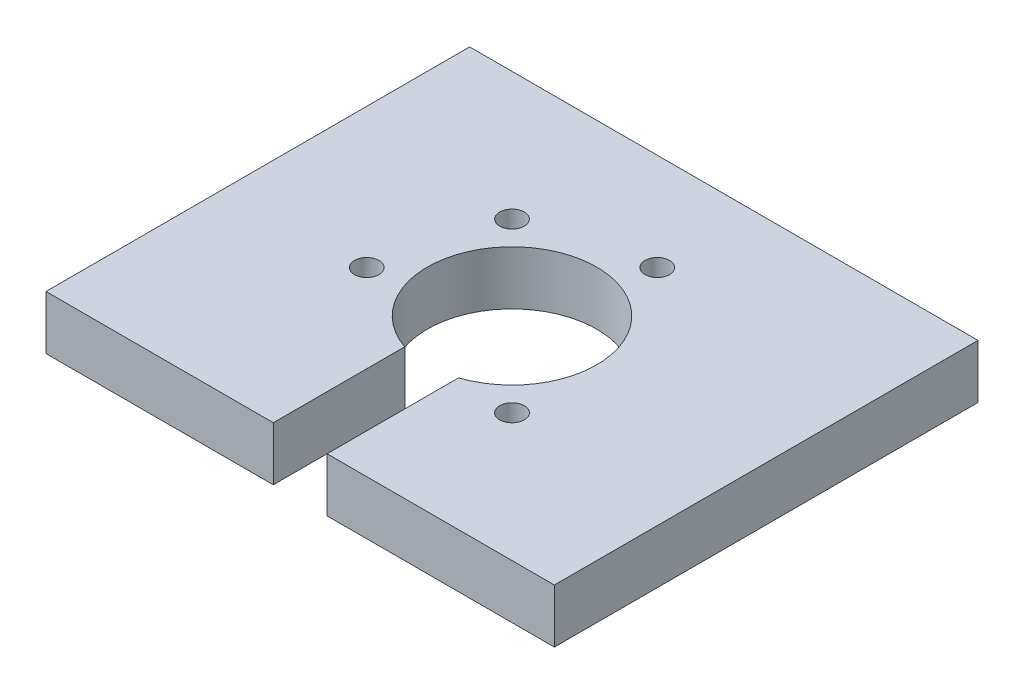
ISO-10303-21;
HEADER;
FILE_DESCRIPTION(('STEP AP214'),'2;1');
FILE_NAME('part.step','',(''),(''),'','','');
FILE_SCHEMA(('AUTOMOTIVE_DESIGN { 1 0 10303 214 1 1 1 1 }'));
ENDSEC;
DATA;
#1=APPLICATION_CONTEXT('core data for automotive mechanical design processes');
#2=APPLICATION_PROTOCOL_DEFINITION('international standard','automotive_design',2000,#1);
#3=PRODUCT_CONTEXT('',#1,'mechanical');
#4=PRODUCT('Part','Part','',(#3));
#5=PRODUCT_RELATED_PRODUCT_CATEGORY('part','',(#4));
#6=PRODUCT_DEFINITION_FORMATION('','',#4);
#7=PRODUCT_DEFINITION_CONTEXT('part definition',#1,'design');
#8=PRODUCT_DEFINITION('design','',#6,#7);
#9=PRODUCT_DEFINITION_SHAPE('','',#8);
#10=(LENGTH_UNIT() NAMED_UNIT(*) SI_UNIT(.MILLI.,.METRE.));
#11=(NAMED_UNIT(*) PLANE_ANGLE_UNIT() SI_UNIT($,.RADIAN.));
#12=(NAMED_UNIT(*) SI_UNIT($,.STERADIAN.) SOLID_ANGLE_UNIT());
#13=UNCERTAINTY_MEASURE_WITH_UNIT(LENGTH_MEASURE(1.E-05),#10,'distance_accuracy_value','');
#14=(GEOMETRIC_REPRESENTATION_CONTEXT(3) GLOBAL_UNCERTAINTY_ASSIGNED_CONTEXT((#13)) GLOBAL_UNIT_ASSIGNED_CONTEXT((#10,
#11,#12)) REPRESENTATION_CONTEXT('',''));
#15=CARTESIAN_POINT('',(0.,0.,0.));
#16=DIRECTION('',(0.,0.,1.));
#17=DIRECTION('',(1.,0.,0.));
#18=AXIS2_PLACEMENT_3D('',#15,#16,#17);
#19=CARTESIAN_POINT('',(0.,6.35,50.));
#20=DIRECTION('',(0.,0.,-1.));
#21=DIRECTION('',(-1.,0.,0.));
#22=AXIS2_PLACEMENT_3D('',#19,#20,#21);
#23=PLANE('',#22);
#24=DIRECTION('',(0.,1.,0.));
#25=VECTOR('',#24,1.);
#26=CARTESIAN_POINT('',(-26.825,0.,50.));
#27=LINE('',#26,#25);
#28=CARTESIAN_POINT('',(-26.825,0.,50.));
#29=VERTEX_POINT('',#28);
#30=CARTESIAN_POINT('',(-26.825,6.35,50.));
#31=VERTEX_POINT('',#30);
#32=EDGE_CURVE('E215',#29,#31,#27,.T.);
#33=ORIENTED_EDGE('',*,*,#32,.F.);
#34=DIRECTION('',(1.,0.,0.));
#35=VECTOR('',#34,1.);
#36=CARTESIAN_POINT('',(0.,0.,50.));
#37=LINE('',#36,#35);
#38=CARTESIAN_POINT('',(0.,0.,50.));
#39=VERTEX_POINT('',#38);
#40=EDGE_CURVE('E88',#29,#39,#37,.T.);
#41=ORIENTED_EDGE('',*,*,#40,.T.);
#42=DIRECTION('',(0.,-1.,0.));
#43=VECTOR('',#42,1.);
#44=CARTESIAN_POINT('',(0.,6.35,50.));
#45=LINE('',#44,#43);
#46=CARTESIAN_POINT('',(0.,6.35,50.));
#47=VERTEX_POINT('',#46);
#48=EDGE_CURVE('E235',#47,#39,#45,.T.);
#49=ORIENTED_EDGE('',*,*,#48,.F.);
#50=DIRECTION('',(1.,0.,0.));
#51=VECTOR('',#50,1.);
#52=CARTESIAN_POINT('',(0.,6.35,50.));
#53=LINE('',#52,#51);
#54=EDGE_CURVE('E66',#31,#47,#53,.T.);
#55=ORIENTED_EDGE('',*,*,#54,.F.);
#56=EDGE_LOOP('',(#33,#41,#49,#55));
#57=FACE_BOUND('',#56,.T.);
#58=ADVANCED_FACE('F41',(#57),#23,.F.);
#59=CARTESIAN_POINT('',(0.,6.35,0.));
#60=DIRECTION('',(0.,-1.,0.));
#61=DIRECTION('',(0.,0.,-1.));
#62=AXIS2_PLACEMENT_3D('',#59,#60,#61);
#63=PLANE('',#62);
#64=CARTESIAN_POINT('',(-26.3765333685647,6.35,11.4770384319531));
#65=DIRECTION('',(0.,1.,0.));
#66=DIRECTION('',(0.,0.,1.));
#67=AXIS2_PLACEMENT_3D('',#64,#65,#66);
#68=CIRCLE('',#67,1.45);
#69=CARTESIAN_POINT('',(-26.3765333685647,6.35,12.9270384319531));
#70=VERTEX_POINT('',#69);
#71=EDGE_CURVE('E158',#70,#70,#68,.T.);
#72=ORIENTED_EDGE('',*,*,#71,.F.);
#73=EDGE_LOOP('',(#72));
#74=FACE_BOUND('',#73,.T.);
#75=CARTESIAN_POINT('',(-39.8994949366117,6.35,15.1005050633884));
#76=DIRECTION('',(0.,1.,0.));
#77=DIRECTION('',(0.,0.,1.));
#78=AXIS2_PLACEMENT_3D('',#75,#76,#77);
#79=CIRCLE('',#78,1.45);
#80=CARTESIAN_POINT('',(-39.8994949366117,6.35,16.5505050633884));
#81=VERTEX_POINT('',#80);
#82=EDGE_CURVE('E166',#81,#81,#79,.T.);
#83=ORIENTED_EDGE('',*,*,#82,.F.);
#84=EDGE_LOOP('',(#83));
#85=FACE_BOUND('',#84,.T.);
#86=CARTESIAN_POINT('',(-43.5229615680469,6.35,28.6234666314354));
#87=DIRECTION('',(0.,1.,0.));
#88=DIRECTION('',(0.,0.,1.));
#89=AXIS2_PLACEMENT_3D('',#86,#87,#88);
#90=CIRCLE('',#89,1.45);
#91=CARTESIAN_POINT('',(-43.5229615680469,6.35,30.0734666314354));
#92=VERTEX_POINT('',#91);
#93=EDGE_CURVE('E174',#92,#92,#90,.T.);
#94=ORIENTED_EDGE('',*,*,#93,.F.);
#95=EDGE_LOOP('',(#94));
#96=FACE_BOUND('',#95,.T.);
#97=CARTESIAN_POINT('',(-20.1005050633884,6.35,34.8994949366117));
#98=DIRECTION('',(0.,1.,0.));
#99=DIRECTION('',(0.,0.,1.));
#100=AXIS2_PLACEMENT_3D('',#97,#98,#99);
#101=CIRCLE('',#100,1.45);
#102=CARTESIAN_POINT('',(-20.1005050633884,6.35,36.3494949366117));
#103=VERTEX_POINT('',#102);
#104=EDGE_CURVE('E182',#103,#103,#101,.T.);
#105=ORIENTED_EDGE('',*,*,#104,.F.);
#106=EDGE_LOOP('',(#105));
#107=FACE_BOUND('',#106,.T.);
#108=DIRECTION('',(0.,0.,1.));
#109=VECTOR('',#108,1.);
#110=CARTESIAN_POINT('',(-26.825,6.35,0.));
#111=LINE('',#110,#109);
#112=CARTESIAN_POINT('',(-26.825,6.35,34.4825827178043));
#113=VERTEX_POINT('',#112);
#114=EDGE_CURVE('E196',#113,#31,#111,.T.);
#115=ORIENTED_EDGE('',*,*,#114,.T.);
#116=ORIENTED_EDGE('',*,*,#54,.T.);
#117=DIRECTION('',(0.,0.,-1.));
#118=VECTOR('',#117,1.);
#119=CARTESIAN_POINT('',(0.,6.35,0.));
#120=LINE('',#119,#118);
#121=CARTESIAN_POINT('',(0.,6.35,0.));
#122=VERTEX_POINT('',#121);
#123=EDGE_CURVE('E222',#47,#122,#120,.T.);
#124=ORIENTED_EDGE('',*,*,#123,.T.);
#125=DIRECTION('',(-1.,0.,0.));
#126=VECTOR('',#125,1.);
#127=CARTESIAN_POINT('',(0.,6.35,0.));
#128=LINE('',#127,#126);
#129=CARTESIAN_POINT('',(-60.,6.35,0.));
#130=VERTEX_POINT('',#129);
#131=EDGE_CURVE('E95',#122,#130,#128,.T.);
#132=ORIENTED_EDGE('',*,*,#131,.T.);
#133=DIRECTION('',(0.,0.,1.));
#134=VECTOR('',#133,1.);
#135=CARTESIAN_POINT('',(-60.,6.35,0.));
#136=LINE('',#135,#134);
#137=CARTESIAN_POINT('',(-60.,6.35,50.));
#138=VERTEX_POINT('',#137);
#139=EDGE_CURVE('E228',#130,#138,#136,.T.);
#140=ORIENTED_EDGE('',*,*,#139,.T.);
#141=CARTESIAN_POINT('',(-33.175,6.35,50.));
#142=VERTEX_POINT('',#141);
#143=EDGE_CURVE('E231',#138,#142,#53,.T.);
#144=ORIENTED_EDGE('',*,*,#143,.T.);
#145=DIRECTION('',(0.,0.,1.));
#146=VECTOR('',#145,1.);
#147=CARTESIAN_POINT('',(-33.175,6.35,0.));
#148=LINE('',#147,#146);
#149=CARTESIAN_POINT('',(-33.175,6.35,34.4825827178043));
#150=VERTEX_POINT('',#149);
#151=EDGE_CURVE('E206',#150,#142,#148,.T.);
#152=ORIENTED_EDGE('',*,*,#151,.F.);
#153=CARTESIAN_POINT('',(-30.,6.35,25.));
#154=DIRECTION('',(0.,1.,0.));
#155=DIRECTION('',(0.,0.,1.));
#156=AXIS2_PLACEMENT_3D('',#153,#154,#155);
#157=CIRCLE('',#156,10.);
#158=EDGE_CURVE('E190',#113,#150,#157,.T.);
#159=ORIENTED_EDGE('',*,*,#158,.F.);
#160=EDGE_LOOP('',(#115,#116,#124,#132,#140,#144,#152,#159));
#161=FACE_BOUND('',#160,.T.);
#162=ADVANCED_FACE('F268',(#74,#85,#96,#107,#161),#63,.F.);
#163=CARTESIAN_POINT('',(0.,0.,0.));
#164=DIRECTION('',(0.,-1.,0.));
#165=DIRECTION('',(0.,0.,-1.));
#166=AXIS2_PLACEMENT_3D('',#163,#164,#165);
#167=PLANE('',#166);
#168=CARTESIAN_POINT('',(-26.3765333685647,0.,11.4770384319531));
#169=DIRECTION('',(0.,1.,0.));
#170=DIRECTION('',(0.,0.,1.));
#171=AXIS2_PLACEMENT_3D('',#168,#169,#170);
#172=CIRCLE('',#171,1.45);
#173=CARTESIAN_POINT('',(-26.3765333685647,0.,12.927038431953));
#174=VERTEX_POINT('',#173);
#175=EDGE_CURVE('E162',#174,#174,#172,.T.);
#176=ORIENTED_EDGE('',*,*,#175,.T.);
#177=EDGE_LOOP('',(#176));
#178=FACE_BOUND('',#177,.T.);
#179=CARTESIAN_POINT('',(-39.8994949366117,0.,15.1005050633884));
#180=DIRECTION('',(0.,1.,0.));
#181=DIRECTION('',(0.,0.,1.));
#182=AXIS2_PLACEMENT_3D('',#179,#180,#181);
#183=CIRCLE('',#182,1.45);
#184=CARTESIAN_POINT('',(-39.8994949366117,0.,16.5505050633884));
#185=VERTEX_POINT('',#184);
#186=EDGE_CURVE('E170',#185,#185,#183,.T.);
#187=ORIENTED_EDGE('',*,*,#186,.T.);
#188=EDGE_LOOP('',(#187));
#189=FACE_BOUND('',#188,.T.);
#190=CARTESIAN_POINT('',(-43.5229615680469,0.,28.6234666314354));
#191=DIRECTION('',(0.,1.,0.));
#192=DIRECTION('',(0.,0.,1.));
#193=AXIS2_PLACEMENT_3D('',#190,#191,#192);
#194=CIRCLE('',#193,1.45);
#195=CARTESIAN_POINT('',(-43.5229615680469,0.,30.0734666314354));
#196=VERTEX_POINT('',#195);
#197=EDGE_CURVE('E178',#196,#196,#194,.T.);
#198=ORIENTED_EDGE('',*,*,#197,.T.);
#199=EDGE_LOOP('',(#198));
#200=FACE_BOUND('',#199,.T.);
#201=CARTESIAN_POINT('',(-20.1005050633884,0.,34.8994949366117));
#202=DIRECTION('',(0.,1.,0.));
#203=DIRECTION('',(0.,0.,1.));
#204=AXIS2_PLACEMENT_3D('',#201,#202,#203);
#205=CIRCLE('',#204,1.45);
#206=CARTESIAN_POINT('',(-20.1005050633884,0.,36.3494949366117));
#207=VERTEX_POINT('',#206);
#208=EDGE_CURVE('E186',#207,#207,#205,.T.);
#209=ORIENTED_EDGE('',*,*,#208,.T.);
#210=EDGE_LOOP('',(#209));
#211=FACE_BOUND('',#210,.T.);
#212=ORIENTED_EDGE('',*,*,#40,.F.);
#213=DIRECTION('',(0.,0.,1.));
#214=VECTOR('',#213,1.);
#215=CARTESIAN_POINT('',(-26.825,0.,0.));
#216=LINE('',#215,#214);
#217=CARTESIAN_POINT('',(-26.825,0.,34.4825827178043));
#218=VERTEX_POINT('',#217);
#219=EDGE_CURVE('E199',#218,#29,#216,.T.);
#220=ORIENTED_EDGE('',*,*,#219,.F.);
#221=CARTESIAN_POINT('',(-30.,0.,25.));
#222=DIRECTION('',(0.,1.,0.));
#223=DIRECTION('',(0.,0.,1.));
#224=AXIS2_PLACEMENT_3D('',#221,#222,#223);
#225=CIRCLE('',#224,10.);
#226=CARTESIAN_POINT('',(-33.175,0.,34.4825827178043));
#227=VERTEX_POINT('',#226);
#228=EDGE_CURVE('E191',#218,#227,#225,.T.);
#229=ORIENTED_EDGE('',*,*,#228,.T.);
#230=DIRECTION('',(0.,0.,1.));
#231=VECTOR('',#230,1.);
#232=CARTESIAN_POINT('',(-33.175,0.,0.));
#233=LINE('',#232,#231);
#234=CARTESIAN_POINT('',(-33.175,0.,50.));
#235=VERTEX_POINT('',#234);
#236=EDGE_CURVE('E195',#227,#235,#233,.T.);
#237=ORIENTED_EDGE('',*,*,#236,.T.);
#238=CARTESIAN_POINT('',(-60.,0.,50.));
#239=VERTEX_POINT('',#238);
#240=EDGE_CURVE('E225',#239,#235,#37,.T.);
#241=ORIENTED_EDGE('',*,*,#240,.F.);
#242=DIRECTION('',(0.,0.,1.));
#243=VECTOR('',#242,1.);
#244=CARTESIAN_POINT('',(-60.,0.,0.));
#245=LINE('',#244,#243);
#246=CARTESIAN_POINT('',(-60.,0.,0.));
#247=VERTEX_POINT('',#246);
#248=EDGE_CURVE('E242',#247,#239,#245,.T.);
#249=ORIENTED_EDGE('',*,*,#248,.F.);
#250=DIRECTION('',(-1.,0.,0.));
#251=VECTOR('',#250,1.);
#252=CARTESIAN_POINT('',(0.,0.,0.));
#253=LINE('',#252,#251);
#254=CARTESIAN_POINT('',(0.,0.,0.));
#255=VERTEX_POINT('',#254);
#256=EDGE_CURVE('E239',#255,#247,#253,.T.);
#257=ORIENTED_EDGE('',*,*,#256,.F.);
#258=DIRECTION('',(0.,0.,-1.));
#259=VECTOR('',#258,1.);
#260=CARTESIAN_POINT('',(0.,0.,0.));
#261=LINE('',#260,#259);
#262=EDGE_CURVE('E214',#39,#255,#261,.T.);
#263=ORIENTED_EDGE('',*,*,#262,.F.);
#264=EDGE_LOOP('',(#212,#220,#229,#237,#241,#249,#257,#263));
#265=FACE_BOUND('',#264,.T.);
#266=ADVANCED_FACE('F262',(#178,#189,#200,#211,#265),#167,.T.);
#267=CARTESIAN_POINT('',(0.,6.35,0.));
#268=DIRECTION('',(-1.,0.,0.));
#269=DIRECTION('',(0.,0.,1.));
#270=AXIS2_PLACEMENT_3D('',#267,#268,#269);
#271=PLANE('',#270);
#272=ORIENTED_EDGE('',*,*,#262,.T.);
#273=DIRECTION('',(0.,-1.,0.));
#274=VECTOR('',#273,1.);
#275=CARTESIAN_POINT('',(0.,6.35,0.));
#276=LINE('',#275,#274);
#277=EDGE_CURVE('E11',#122,#255,#276,.T.);
#278=ORIENTED_EDGE('',*,*,#277,.F.);
#279=ORIENTED_EDGE('',*,*,#123,.F.);
#280=ORIENTED_EDGE('',*,*,#48,.T.);
#281=EDGE_LOOP('',(#272,#278,#279,#280));
#282=FACE_BOUND('',#281,.T.);
#283=ADVANCED_FACE('F43',(#282),#271,.F.);
#284=CARTESIAN_POINT('',(0.,6.35,0.));
#285=DIRECTION('',(0.,0.,1.));
#286=DIRECTION('',(1.,0.,0.));
#287=AXIS2_PLACEMENT_3D('',#284,#285,#286);
#288=PLANE('',#287);
#289=CARTESIAN_POINT('',(-8.,3.175,0.));
#290=DIRECTION('',(0.,0.,-1.));
#291=DIRECTION('',(-1.,0.,0.));
#292=AXIS2_PLACEMENT_3D('',#289,#290,#291);
#293=CIRCLE('',#292,1.64999999999999);
#294=CARTESIAN_POINT('',(-9.64999999999999,3.175,0.));
#295=VERTEX_POINT('',#294);
#296=EDGE_CURVE('E137',#295,#295,#293,.T.);
#297=ORIENTED_EDGE('',*,*,#296,.F.);
#298=EDGE_LOOP('',(#297));
#299=FACE_BOUND('',#298,.T.);
#300=CARTESIAN_POINT('',(-30.,3.175,0.));
#301=DIRECTION('',(0.,0.,-1.));
#302=DIRECTION('',(-1.,0.,0.));
#303=AXIS2_PLACEMENT_3D('',#300,#301,#302);
#304=CIRCLE('',#303,1.64999999999999);
#305=CARTESIAN_POINT('',(-31.65,3.175,0.));
#306=VERTEX_POINT('',#305);
#307=EDGE_CURVE('E136',#306,#306,#304,.T.);
#308=ORIENTED_EDGE('',*,*,#307,.F.);
#309=EDGE_LOOP('',(#308));
#310=FACE_BOUND('',#309,.T.);
#311=CARTESIAN_POINT('',(-52.,3.175,0.));
#312=DIRECTION('',(0.,0.,-1.));
#313=DIRECTION('',(-1.,0.,0.));
#314=AXIS2_PLACEMENT_3D('',#311,#312,#313);
#315=CIRCLE('',#314,1.64999999999999);
#316=CARTESIAN_POINT('',(-53.65,3.175,0.));
#317=VERTEX_POINT('',#316);
#318=EDGE_CURVE('E150',#317,#317,#315,.T.);
#319=ORIENTED_EDGE('',*,*,#318,.F.);
#320=EDGE_LOOP('',(#319));
#321=FACE_BOUND('',#320,.T.);
#322=ORIENTED_EDGE('',*,*,#256,.T.);
#323=DIRECTION('',(0.,-1.,0.));
#324=VECTOR('',#323,1.);
#325=CARTESIAN_POINT('',(-60.,6.35,0.));
#326=LINE('',#325,#324);
#327=EDGE_CURVE('E50',#130,#247,#326,.T.);
#328=ORIENTED_EDGE('',*,*,#327,.F.);
#329=ORIENTED_EDGE('',*,*,#131,.F.);
#330=ORIENTED_EDGE('',*,*,#277,.T.);
#331=EDGE_LOOP('',(#322,#328,#329,#330));
#332=FACE_BOUND('',#331,.T.);
#333=ADVANCED_FACE('F273',(#299,#310,#321,#332),#288,.F.);
#334=CARTESIAN_POINT('',(-60.,6.35,0.));
#335=DIRECTION('',(1.,0.,0.));
#336=DIRECTION('',(0.,0.,-1.));
#337=AXIS2_PLACEMENT_3D('',#334,#335,#336);
#338=PLANE('',#337);
#339=ORIENTED_EDGE('',*,*,#248,.T.);
#340=DIRECTION('',(0.,-1.,0.));
#341=VECTOR('',#340,1.);
#342=CARTESIAN_POINT('',(-60.,6.35,50.));
#343=LINE('',#342,#341);
#344=EDGE_CURVE('E250',#138,#239,#343,.T.);
#345=ORIENTED_EDGE('',*,*,#344,.F.);
#346=ORIENTED_EDGE('',*,*,#139,.F.);
#347=ORIENTED_EDGE('',*,*,#327,.T.);
#348=EDGE_LOOP('',(#339,#345,#346,#347));
#349=FACE_BOUND('',#348,.T.);
#350=ADVANCED_FACE('F258',(#349),#338,.F.);
#351=ORIENTED_EDGE('',*,*,#240,.T.);
#352=DIRECTION('',(0.,1.,0.));
#353=VECTOR('',#352,1.);
#354=CARTESIAN_POINT('',(-33.175,0.,50.));
#355=LINE('',#354,#353);
#356=EDGE_CURVE('E57',#235,#142,#355,.T.);
#357=ORIENTED_EDGE('',*,*,#356,.T.);
#358=ORIENTED_EDGE('',*,*,#143,.F.);
#359=ORIENTED_EDGE('',*,*,#344,.T.);
#360=EDGE_LOOP('',(#351,#357,#358,#359));
#361=FACE_BOUND('',#360,.T.);
#362=ADVANCED_FACE('F265',(#361),#23,.F.);
#363=CARTESIAN_POINT('',(-30.,0.,25.));
#364=DIRECTION('',(0.,1.,0.));
#365=DIRECTION('',(0.,0.,1.));
#366=AXIS2_PLACEMENT_3D('',#363,#364,#365);
#367=CYLINDRICAL_SURFACE('',#366,10.);
#368=ORIENTED_EDGE('',*,*,#158,.T.);
#369=DIRECTION('',(0.,1.,0.));
#370=VECTOR('',#369,1.);
#371=CARTESIAN_POINT('',(-33.175,0.,34.4825827178043));
#372=LINE('',#371,#370);
#373=EDGE_CURVE('E202',#227,#150,#372,.T.);
#374=ORIENTED_EDGE('',*,*,#373,.F.);
#375=ORIENTED_EDGE('',*,*,#228,.F.);
#376=DIRECTION('',(0.,1.,0.));
#377=VECTOR('',#376,1.);
#378=CARTESIAN_POINT('',(-26.825,0.,34.4825827178043));
#379=LINE('',#378,#377);
#380=EDGE_CURVE('E211',#218,#113,#379,.T.);
#381=ORIENTED_EDGE('',*,*,#380,.T.);
#382=EDGE_LOOP('',(#368,#374,#375,#381));
#383=FACE_BOUND('',#382,.T.);
#384=ADVANCED_FACE('F292',(#383),#367,.F.);
#385=CARTESIAN_POINT('',(-26.825,0.,0.));
#386=DIRECTION('',(-1.,0.,0.));
#387=DIRECTION('',(0.,0.,1.));
#388=AXIS2_PLACEMENT_3D('',#385,#386,#387);
#389=PLANE('',#388);
#390=ORIENTED_EDGE('',*,*,#114,.F.);
#391=ORIENTED_EDGE('',*,*,#380,.F.);
#392=ORIENTED_EDGE('',*,*,#219,.T.);
#393=ORIENTED_EDGE('',*,*,#32,.T.);
#394=EDGE_LOOP('',(#390,#391,#392,#393));
#395=FACE_BOUND('',#394,.T.);
#396=ADVANCED_FACE('F296',(#395),#389,.T.);
#397=CARTESIAN_POINT('',(-33.175,0.,0.));
#398=DIRECTION('',(-1.,0.,0.));
#399=DIRECTION('',(0.,0.,1.));
#400=AXIS2_PLACEMENT_3D('',#397,#398,#399);
#401=PLANE('',#400);
#402=ORIENTED_EDGE('',*,*,#151,.T.);
#403=ORIENTED_EDGE('',*,*,#356,.F.);
#404=ORIENTED_EDGE('',*,*,#236,.F.);
#405=ORIENTED_EDGE('',*,*,#373,.T.);
#406=EDGE_LOOP('',(#402,#403,#404,#405));
#407=FACE_BOUND('',#406,.T.);
#408=ADVANCED_FACE('F302',(#407),#401,.F.);
#409=CARTESIAN_POINT('',(-20.1005050633884,6.35,34.8994949366117));
#410=DIRECTION('',(0.,1.,0.));
#411=DIRECTION('',(0.,0.,1.));
#412=AXIS2_PLACEMENT_3D('',#409,#410,#411);
#413=CYLINDRICAL_SURFACE('',#412,1.45);
#414=ORIENTED_EDGE('',*,*,#208,.F.);
#415=EDGE_LOOP('',(#414));
#416=FACE_BOUND('',#415,.T.);
#417=ORIENTED_EDGE('',*,*,#104,.T.);
#418=EDGE_LOOP('',(#417));
#419=FACE_BOUND('',#418,.T.);
#420=ADVANCED_FACE('F318',(#416,#419),#413,.F.);
#421=CARTESIAN_POINT('',(-43.5229615680469,6.35,28.6234666314354));
#422=DIRECTION('',(0.,1.,0.));
#423=DIRECTION('',(0.,0.,1.));
#424=AXIS2_PLACEMENT_3D('',#421,#422,#423);
#425=CYLINDRICAL_SURFACE('',#424,1.45);
#426=ORIENTED_EDGE('',*,*,#197,.F.);
#427=EDGE_LOOP('',(#426));
#428=FACE_BOUND('',#427,.T.);
#429=ORIENTED_EDGE('',*,*,#93,.T.);
#430=EDGE_LOOP('',(#429));
#431=FACE_BOUND('',#430,.T.);
#432=ADVANCED_FACE('F321',(#428,#431),#425,.F.);
#433=CARTESIAN_POINT('',(-39.8994949366117,6.35,15.1005050633884));
#434=DIRECTION('',(0.,1.,0.));
#435=DIRECTION('',(0.,0.,1.));
#436=AXIS2_PLACEMENT_3D('',#433,#434,#435);
#437=CYLINDRICAL_SURFACE('',#436,1.45);
#438=ORIENTED_EDGE('',*,*,#186,.F.);
#439=EDGE_LOOP('',(#438));
#440=FACE_BOUND('',#439,.T.);
#441=ORIENTED_EDGE('',*,*,#82,.T.);
#442=EDGE_LOOP('',(#441));
#443=FACE_BOUND('',#442,.T.);
#444=ADVANCED_FACE('F329',(#440,#443),#437,.F.);
#445=CARTESIAN_POINT('',(-26.3765333685647,6.35,11.4770384319531));
#446=DIRECTION('',(0.,1.,0.));
#447=DIRECTION('',(0.,0.,1.));
#448=AXIS2_PLACEMENT_3D('',#445,#446,#447);
#449=CYLINDRICAL_SURFACE('',#448,1.45);
#450=ORIENTED_EDGE('',*,*,#175,.F.);
#451=EDGE_LOOP('',(#450));
#452=FACE_BOUND('',#451,.T.);
#453=ORIENTED_EDGE('',*,*,#71,.T.);
#454=EDGE_LOOP('',(#453));
#455=FACE_BOUND('',#454,.T.);
#456=ADVANCED_FACE('F335',(#452,#455),#449,.F.);
#457=CARTESIAN_POINT('',(-52.,3.175,6.35));
#458=DIRECTION('',(0.,0.,-1.));
#459=DIRECTION('',(-1.,0.,0.));
#460=AXIS2_PLACEMENT_3D('',#457,#458,#459);
#461=CONICAL_SURFACE('',#460,1.65,1.02974425867665);
#462=CARTESIAN_POINT('',(-52.,3.175,7.34142002139547));
#463=VERTEX_POINT('',#462);
#464=VERTEX_LOOP('',#463);
#465=FACE_BOUND('',#464,.T.);
#466=CARTESIAN_POINT('',(-52.,3.175,6.35));
#467=DIRECTION('',(0.,0.,-1.));
#468=DIRECTION('',(-1.,0.,0.));
#469=AXIS2_PLACEMENT_3D('',#466,#467,#468);
#470=CIRCLE('',#469,1.65);
#471=CARTESIAN_POINT('',(-53.65,3.175,6.35));
#472=VERTEX_POINT('',#471);
#473=EDGE_CURVE('E154',#472,#472,#470,.T.);
#474=ORIENTED_EDGE('',*,*,#473,.T.);
#475=EDGE_LOOP('',(#474));
#476=FACE_BOUND('',#475,.T.);
#477=ADVANCED_FACE('F339',(#465,#476),#461,.F.);
#478=CARTESIAN_POINT('',(-52.,3.175,0.));
#479=DIRECTION('',(0.,0.,-1.));
#480=DIRECTION('',(-1.,0.,0.));
#481=AXIS2_PLACEMENT_3D('',#478,#479,#480);
#482=CYLINDRICAL_SURFACE('',#481,1.65);
#483=ORIENTED_EDGE('',*,*,#473,.F.);
#484=EDGE_LOOP('',(#483));
#485=FACE_BOUND('',#484,.T.);
#486=ORIENTED_EDGE('',*,*,#318,.T.);
#487=EDGE_LOOP('',(#486));
#488=FACE_BOUND('',#487,.T.);
#489=ADVANCED_FACE('F343',(#485,#488),#482,.F.);
#490=CARTESIAN_POINT('',(-30.,3.175,6.35));
#491=DIRECTION('',(0.,0.,-1.));
#492=DIRECTION('',(-1.,0.,0.));
#493=AXIS2_PLACEMENT_3D('',#490,#491,#492);
#494=CONICAL_SURFACE('',#493,1.65,1.02974425867665);
#495=CARTESIAN_POINT('',(-30.,3.175,7.34142002139547));
#496=VERTEX_POINT('',#495);
#497=VERTEX_LOOP('',#496);
#498=FACE_BOUND('',#497,.T.);
#499=CARTESIAN_POINT('',(-30.,3.175,6.35));
#500=DIRECTION('',(0.,0.,-1.));
#501=DIRECTION('',(-1.,0.,0.));
#502=AXIS2_PLACEMENT_3D('',#499,#500,#501);
#503=CIRCLE('',#502,1.65);
#504=CARTESIAN_POINT('',(-31.65,3.175,6.35));
#505=VERTEX_POINT('',#504);
#506=EDGE_CURVE('E142',#505,#505,#503,.T.);
#507=ORIENTED_EDGE('',*,*,#506,.T.);
#508=EDGE_LOOP('',(#507));
#509=FACE_BOUND('',#508,.T.);
#510=ADVANCED_FACE('F347',(#498,#509),#494,.F.);
#511=CARTESIAN_POINT('',(-30.,3.175,0.));
#512=DIRECTION('',(0.,0.,-1.));
#513=DIRECTION('',(-1.,0.,0.));
#514=AXIS2_PLACEMENT_3D('',#511,#512,#513);
#515=CYLINDRICAL_SURFACE('',#514,1.65);
#516=ORIENTED_EDGE('',*,*,#506,.F.);
#517=EDGE_LOOP('',(#516));
#518=FACE_BOUND('',#517,.T.);
#519=ORIENTED_EDGE('',*,*,#307,.T.);
#520=EDGE_LOOP('',(#519));
#521=FACE_BOUND('',#520,.T.);
#522=ADVANCED_FACE('F129',(#518,#521),#515,.F.);
#523=CARTESIAN_POINT('',(-8.,3.175,6.35));
#524=DIRECTION('',(0.,0.,-1.));
#525=DIRECTION('',(-1.,0.,0.));
#526=AXIS2_PLACEMENT_3D('',#523,#524,#525);
#527=CONICAL_SURFACE('',#526,1.65,1.02974425867665);
#528=CARTESIAN_POINT('',(-8.,3.175,7.34142002139547));
#529=VERTEX_POINT('',#528);
#530=VERTEX_LOOP('',#529);
#531=FACE_BOUND('',#530,.T.);
#532=CARTESIAN_POINT('',(-8.,3.175,6.35));
#533=DIRECTION('',(0.,0.,-1.));
#534=DIRECTION('',(-1.,0.,0.));
#535=AXIS2_PLACEMENT_3D('',#532,#533,#534);
#536=CIRCLE('',#535,1.65);
#537=CARTESIAN_POINT('',(-9.65,3.175,6.35));
#538=VERTEX_POINT('',#537);
#539=EDGE_CURVE('E133',#538,#538,#536,.T.);
#540=ORIENTED_EDGE('',*,*,#539,.T.);
#541=EDGE_LOOP('',(#540));
#542=FACE_BOUND('',#541,.T.);
#543=ADVANCED_FACE('F125',(#531,#542),#527,.F.);
#544=CARTESIAN_POINT('',(-8.,3.175,0.));
#545=DIRECTION('',(0.,0.,-1.));
#546=DIRECTION('',(-1.,0.,0.));
#547=AXIS2_PLACEMENT_3D('',#544,#545,#546);
#548=CYLINDRICAL_SURFACE('',#547,1.64999999999999);
#549=ORIENTED_EDGE('',*,*,#539,.F.);
#550=EDGE_LOOP('',(#549));
#551=FACE_BOUND('',#550,.T.);
#552=ORIENTED_EDGE('',*,*,#296,.T.);
#553=EDGE_LOOP('',(#552));
#554=FACE_BOUND('',#553,.T.);
#555=ADVANCED_FACE('F128',(#551,#554),#548,.F.);
#556=CLOSED_SHELL('',(#58,#162,#266,#283,#333,#350,#362,#384,#396,#408,#420,#432,#444,#456,#477,
#489,#510,#522,#543,#555));
#557=MANIFOLD_SOLID_BREP('B2',#556);
#558=ADVANCED_BREP_SHAPE_REPRESENTATION('',(#18,#557),#14);
#559=SHAPE_DEFINITION_REPRESENTATION(#9,#558);
ENDSEC;
END-ISO-10303-21;
